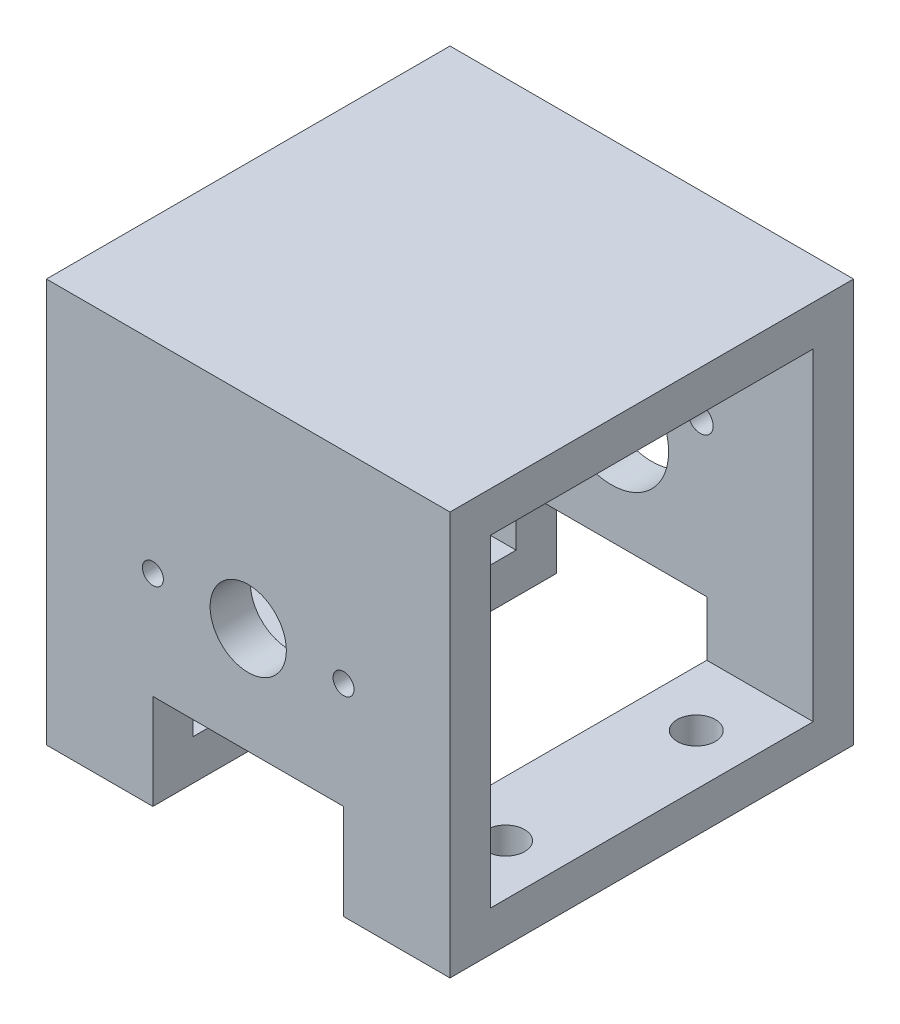
ISO-10303-21;
HEADER;
FILE_DESCRIPTION(('STEP AP214'),'2;1');
FILE_NAME('part.step','',(''),(''),'','','');
FILE_SCHEMA(('AUTOMOTIVE_DESIGN { 1 0 10303 214 1 1 1 1 }'));
ENDSEC;
DATA;
#1=APPLICATION_CONTEXT('core data for automotive mechanical design processes');
#2=APPLICATION_PROTOCOL_DEFINITION('international standard','automotive_design',2000,#1);
#3=PRODUCT_CONTEXT('',#1,'mechanical');
#4=PRODUCT('Part','Part','',(#3));
#5=PRODUCT_RELATED_PRODUCT_CATEGORY('part','',(#4));
#6=PRODUCT_DEFINITION_FORMATION('','',#4);
#7=PRODUCT_DEFINITION_CONTEXT('part definition',#1,'design');
#8=PRODUCT_DEFINITION('design','',#6,#7);
#9=PRODUCT_DEFINITION_SHAPE('','',#8);
#10=(LENGTH_UNIT() NAMED_UNIT(*) SI_UNIT(.MILLI.,.METRE.));
#11=(NAMED_UNIT(*) PLANE_ANGLE_UNIT() SI_UNIT($,.RADIAN.));
#12=(NAMED_UNIT(*) SI_UNIT($,.STERADIAN.) SOLID_ANGLE_UNIT());
#13=UNCERTAINTY_MEASURE_WITH_UNIT(LENGTH_MEASURE(1.E-05),#10,'distance_accuracy_value','');
#14=(GEOMETRIC_REPRESENTATION_CONTEXT(3) GLOBAL_UNCERTAINTY_ASSIGNED_CONTEXT((#13)) GLOBAL_UNIT_ASSIGNED_CONTEXT((#10,
#11,#12)) REPRESENTATION_CONTEXT('',''));
#15=CARTESIAN_POINT('',(0.,0.,0.));
#16=DIRECTION('',(0.,0.,1.));
#17=DIRECTION('',(1.,0.,0.));
#18=AXIS2_PLACEMENT_3D('',#15,#16,#17);
#19=CARTESIAN_POINT('',(0.,-31.75,0.));
#20=DIRECTION('',(0.,-1.,0.));
#21=DIRECTION('',(0.,0.,-1.));
#22=AXIS2_PLACEMENT_3D('',#19,#20,#21);
#23=PLANE('',#22);
#24=CARTESIAN_POINT('',(23.75,-31.75,-15.));
#25=DIRECTION('',(0.,1.,0.));
#26=DIRECTION('',(0.,0.,1.));
#27=AXIS2_PLACEMENT_3D('',#24,#25,#26);
#28=CIRCLE('',#27,3.);
#29=CARTESIAN_POINT('',(23.75,-31.75,-12.));
#30=VERTEX_POINT('',#29);
#31=EDGE_CURVE('E632',#30,#30,#28,.T.);
#32=ORIENTED_EDGE('',*,*,#31,.T.);
#33=EDGE_LOOP('',(#32));
#34=FACE_BOUND('',#33,.T.);
#35=CARTESIAN_POINT('',(23.75,-31.75,15.));
#36=DIRECTION('',(0.,1.,0.));
#37=DIRECTION('',(0.,0.,-1.));
#38=AXIS2_PLACEMENT_3D('',#35,#36,#37);
#39=CIRCLE('',#38,3.);
#40=CARTESIAN_POINT('',(23.75,-31.75,12.));
#41=VERTEX_POINT('',#40);
#42=EDGE_CURVE('E633',#41,#41,#39,.T.);
#43=ORIENTED_EDGE('',*,*,#42,.T.);
#44=EDGE_LOOP('',(#43));
#45=FACE_BOUND('',#44,.T.);
#46=DIRECTION('',(0.,0.,1.));
#47=VECTOR('',#46,1.);
#48=CARTESIAN_POINT('',(15.,-31.75,-31.75));
#49=LINE('',#48,#47);
#50=CARTESIAN_POINT('',(15.,-31.75,-31.75));
#51=VERTEX_POINT('',#50);
#52=CARTESIAN_POINT('',(15.,-31.75,31.75));
#53=VERTEX_POINT('',#52);
#54=EDGE_CURVE('E169',#51,#53,#49,.T.);
#55=ORIENTED_EDGE('',*,*,#54,.F.);
#56=DIRECTION('',(-1.,0.,0.));
#57=VECTOR('',#56,1.);
#58=CARTESIAN_POINT('',(-31.75,-31.75,-31.75));
#59=LINE('',#58,#57);
#60=CARTESIAN_POINT('',(31.75,-31.75,-31.75));
#61=VERTEX_POINT('',#60);
#62=EDGE_CURVE('E256',#61,#51,#59,.T.);
#63=ORIENTED_EDGE('',*,*,#62,.F.);
#64=DIRECTION('',(0.,0.,-1.));
#65=VECTOR('',#64,1.);
#66=CARTESIAN_POINT('',(31.75,-31.75,31.75));
#67=LINE('',#66,#65);
#68=CARTESIAN_POINT('',(31.75,-31.75,31.75));
#69=VERTEX_POINT('',#68);
#70=EDGE_CURVE('E235',#69,#61,#67,.T.);
#71=ORIENTED_EDGE('',*,*,#70,.F.);
#72=DIRECTION('',(1.,0.,0.));
#73=VECTOR('',#72,1.);
#74=CARTESIAN_POINT('',(-31.75,-31.75,31.75));
#75=LINE('',#74,#73);
#76=EDGE_CURVE('E261',#53,#69,#75,.T.);
#77=ORIENTED_EDGE('',*,*,#76,.F.);
#78=EDGE_LOOP('',(#55,#63,#71,#77));
#79=FACE_BOUND('',#78,.T.);
#80=ADVANCED_FACE('F39',(#34,#45,#79),#23,.T.);
#81=CARTESIAN_POINT('',(0.,-25.4,0.));
#82=DIRECTION('',(0.,-1.,0.));
#83=DIRECTION('',(0.,0.,-1.));
#84=AXIS2_PLACEMENT_3D('',#81,#82,#83);
#85=PLANE('',#84);
#86=CARTESIAN_POINT('',(23.75,-25.4,-15.));
#87=DIRECTION('',(0.,-1.,0.));
#88=DIRECTION('',(0.,0.,-1.));
#89=AXIS2_PLACEMENT_3D('',#86,#87,#88);
#90=CIRCLE('',#89,3.);
#91=CARTESIAN_POINT('',(23.75,-25.4,-18.));
#92=VERTEX_POINT('',#91);
#93=EDGE_CURVE('E43',#92,#92,#90,.T.);
#94=ORIENTED_EDGE('',*,*,#93,.T.);
#95=EDGE_LOOP('',(#94));
#96=FACE_BOUND('',#95,.T.);
#97=CARTESIAN_POINT('',(23.75,-25.4,15.));
#98=DIRECTION('',(0.,-1.,0.));
#99=DIRECTION('',(0.,0.,-1.));
#100=AXIS2_PLACEMENT_3D('',#97,#98,#99);
#101=CIRCLE('',#100,3.);
#102=CARTESIAN_POINT('',(23.75,-25.4,12.));
#103=VERTEX_POINT('',#102);
#104=EDGE_CURVE('E298',#103,#103,#101,.T.);
#105=ORIENTED_EDGE('',*,*,#104,.T.);
#106=EDGE_LOOP('',(#105));
#107=FACE_BOUND('',#106,.T.);
#108=DIRECTION('',(-1.,0.,0.));
#109=VECTOR('',#108,1.);
#110=CARTESIAN_POINT('',(0.,-25.4,-25.4));
#111=LINE('',#110,#109);
#112=CARTESIAN_POINT('',(31.75,-25.4,-25.4));
#113=VERTEX_POINT('',#112);
#114=CARTESIAN_POINT('',(15.,-25.4,-25.4));
#115=VERTEX_POINT('',#114);
#116=EDGE_CURVE('E205',#113,#115,#111,.T.);
#117=ORIENTED_EDGE('',*,*,#116,.T.);
#118=DIRECTION('',(0.,0.,1.));
#119=VECTOR('',#118,1.);
#120=CARTESIAN_POINT('',(15.,-25.4,0.));
#121=LINE('',#120,#119);
#122=CARTESIAN_POINT('',(15.,-25.4,25.4));
#123=VERTEX_POINT('',#122);
#124=EDGE_CURVE('E48',#115,#123,#121,.T.);
#125=ORIENTED_EDGE('',*,*,#124,.T.);
#126=DIRECTION('',(1.,0.,0.));
#127=VECTOR('',#126,1.);
#128=CARTESIAN_POINT('',(0.,-25.4,25.4));
#129=LINE('',#128,#127);
#130=CARTESIAN_POINT('',(31.75,-25.4,25.4));
#131=VERTEX_POINT('',#130);
#132=EDGE_CURVE('E222',#123,#131,#129,.T.);
#133=ORIENTED_EDGE('',*,*,#132,.T.);
#134=DIRECTION('',(0.,0.,-1.));
#135=VECTOR('',#134,1.);
#136=CARTESIAN_POINT('',(31.75,-25.4,0.));
#137=LINE('',#136,#135);
#138=EDGE_CURVE('E204',#131,#113,#137,.T.);
#139=ORIENTED_EDGE('',*,*,#138,.T.);
#140=EDGE_LOOP('',(#117,#125,#133,#139));
#141=FACE_BOUND('',#140,.T.);
#142=ADVANCED_FACE('F352',(#96,#107,#141),#85,.F.);
#143=CARTESIAN_POINT('',(31.75,31.75,31.75));
#144=DIRECTION('',(-1.,0.,0.));
#145=DIRECTION('',(0.,0.,1.));
#146=AXIS2_PLACEMENT_3D('',#143,#144,#145);
#147=PLANE('',#146);
#148=ORIENTED_EDGE('',*,*,#70,.T.);
#149=DIRECTION('',(0.,-1.,0.));
#150=VECTOR('',#149,1.);
#151=CARTESIAN_POINT('',(31.75,31.75,-31.75));
#152=LINE('',#151,#150);
#153=CARTESIAN_POINT('',(31.75,31.75,-31.75));
#154=VERTEX_POINT('',#153);
#155=EDGE_CURVE('E271',#154,#61,#152,.T.);
#156=ORIENTED_EDGE('',*,*,#155,.F.);
#157=DIRECTION('',(0.,0.,-1.));
#158=VECTOR('',#157,1.);
#159=CARTESIAN_POINT('',(31.75,31.75,31.75));
#160=LINE('',#159,#158);
#161=CARTESIAN_POINT('',(31.75,31.75,31.75));
#162=VERTEX_POINT('',#161);
#163=EDGE_CURVE('E242',#162,#154,#160,.T.);
#164=ORIENTED_EDGE('',*,*,#163,.F.);
#165=DIRECTION('',(0.,-1.,0.));
#166=VECTOR('',#165,1.);
#167=CARTESIAN_POINT('',(31.75,31.75,31.75));
#168=LINE('',#167,#166);
#169=EDGE_CURVE('E252',#162,#69,#168,.T.);
#170=ORIENTED_EDGE('',*,*,#169,.T.);
#171=EDGE_LOOP('',(#148,#156,#164,#170));
#172=FACE_BOUND('',#171,.T.);
#173=ORIENTED_EDGE('',*,*,#138,.F.);
#174=DIRECTION('',(0.,-1.,0.));
#175=VECTOR('',#174,1.);
#176=CARTESIAN_POINT('',(31.75,31.75,25.4));
#177=LINE('',#176,#175);
#178=CARTESIAN_POINT('',(31.75,25.4,25.4));
#179=VERTEX_POINT('',#178);
#180=EDGE_CURVE('E218',#179,#131,#177,.T.);
#181=ORIENTED_EDGE('',*,*,#180,.F.);
#182=DIRECTION('',(0.,0.,-1.));
#183=VECTOR('',#182,1.);
#184=CARTESIAN_POINT('',(31.75,25.4,0.));
#185=LINE('',#184,#183);
#186=CARTESIAN_POINT('',(31.75,25.4,-25.4));
#187=VERTEX_POINT('',#186);
#188=EDGE_CURVE('E214',#179,#187,#185,.T.);
#189=ORIENTED_EDGE('',*,*,#188,.T.);
#190=DIRECTION('',(0.,-1.,0.));
#191=VECTOR('',#190,1.);
#192=CARTESIAN_POINT('',(31.75,31.75,-25.4));
#193=LINE('',#192,#191);
#194=EDGE_CURVE('E226',#187,#113,#193,.T.);
#195=ORIENTED_EDGE('',*,*,#194,.T.);
#196=EDGE_LOOP('',(#173,#181,#189,#195));
#197=FACE_BOUND('',#196,.T.);
#198=ADVANCED_FACE('F41',(#172,#197),#147,.F.);
#199=CARTESIAN_POINT('',(-31.75,31.75,31.75));
#200=DIRECTION('',(1.,0.,0.));
#201=DIRECTION('',(0.,0.,-1.));
#202=AXIS2_PLACEMENT_3D('',#199,#200,#201);
#203=PLANE('',#202);
#204=DIRECTION('',(0.,0.,1.));
#205=VECTOR('',#204,1.);
#206=CARTESIAN_POINT('',(-31.75,-31.75,31.75));
#207=LINE('',#206,#205);
#208=CARTESIAN_POINT('',(-31.75,-31.75,-31.75));
#209=VERTEX_POINT('',#208);
#210=CARTESIAN_POINT('',(-31.75,-31.75,31.75));
#211=VERTEX_POINT('',#210);
#212=EDGE_CURVE('E259',#209,#211,#207,.T.);
#213=ORIENTED_EDGE('',*,*,#212,.T.);
#214=DIRECTION('',(0.,-1.,0.));
#215=VECTOR('',#214,1.);
#216=CARTESIAN_POINT('',(-31.75,31.75,31.75));
#217=LINE('',#216,#215);
#218=CARTESIAN_POINT('',(-31.75,31.75,31.75));
#219=VERTEX_POINT('',#218);
#220=EDGE_CURVE('E265',#219,#211,#217,.T.);
#221=ORIENTED_EDGE('',*,*,#220,.F.);
#222=DIRECTION('',(0.,0.,1.));
#223=VECTOR('',#222,1.);
#224=CARTESIAN_POINT('',(-31.75,31.75,31.75));
#225=LINE('',#224,#223);
#226=CARTESIAN_POINT('',(-31.75,31.75,-31.75));
#227=VERTEX_POINT('',#226);
#228=EDGE_CURVE('E248',#227,#219,#225,.T.);
#229=ORIENTED_EDGE('',*,*,#228,.F.);
#230=DIRECTION('',(0.,-1.,0.));
#231=VECTOR('',#230,1.);
#232=CARTESIAN_POINT('',(-31.75,31.75,-31.75));
#233=LINE('',#232,#231);
#234=EDGE_CURVE('E268',#227,#209,#233,.T.);
#235=ORIENTED_EDGE('',*,*,#234,.T.);
#236=EDGE_LOOP('',(#213,#221,#229,#235));
#237=FACE_BOUND('',#236,.T.);
#238=DIRECTION('',(0.,0.,1.));
#239=VECTOR('',#238,1.);
#240=CARTESIAN_POINT('',(-31.75,-25.4,0.));
#241=LINE('',#240,#239);
#242=CARTESIAN_POINT('',(-31.75,-25.4,-25.4));
#243=VERTEX_POINT('',#242);
#244=CARTESIAN_POINT('',(-31.75,-25.4,25.4));
#245=VERTEX_POINT('',#244);
#246=EDGE_CURVE('E208',#243,#245,#241,.T.);
#247=ORIENTED_EDGE('',*,*,#246,.F.);
#248=DIRECTION('',(0.,-1.,0.));
#249=VECTOR('',#248,1.);
#250=CARTESIAN_POINT('',(-31.75,31.75,-25.4));
#251=LINE('',#250,#249);
#252=CARTESIAN_POINT('',(-31.75,25.4,-25.4));
#253=VERTEX_POINT('',#252);
#254=EDGE_CURVE('E223',#253,#243,#251,.T.);
#255=ORIENTED_EDGE('',*,*,#254,.F.);
#256=DIRECTION('',(0.,0.,1.));
#257=VECTOR('',#256,1.);
#258=CARTESIAN_POINT('',(-31.75,25.4,0.));
#259=LINE('',#258,#257);
#260=CARTESIAN_POINT('',(-31.75,25.4,25.4));
#261=VERTEX_POINT('',#260);
#262=EDGE_CURVE('E213',#253,#261,#259,.T.);
#263=ORIENTED_EDGE('',*,*,#262,.T.);
#264=DIRECTION('',(0.,-1.,0.));
#265=VECTOR('',#264,1.);
#266=CARTESIAN_POINT('',(-31.75,31.75,25.4));
#267=LINE('',#266,#265);
#268=EDGE_CURVE('E227',#261,#245,#267,.T.);
#269=ORIENTED_EDGE('',*,*,#268,.T.);
#270=EDGE_LOOP('',(#247,#255,#263,#269));
#271=FACE_BOUND('',#270,.T.);
#272=ADVANCED_FACE('F346',(#237,#271),#203,.F.);
#273=CARTESIAN_POINT('',(-31.75,31.75,-31.75));
#274=DIRECTION('',(0.,0.,1.));
#275=DIRECTION('',(1.,0.,0.));
#276=AXIS2_PLACEMENT_3D('',#273,#274,#275);
#277=PLANE('',#276);
#278=CARTESIAN_POINT('',(14.,7.,-31.75));
#279=DIRECTION('',(0.,0.,1.));
#280=DIRECTION('',(-1.,0.,0.));
#281=AXIS2_PLACEMENT_3D('',#278,#279,#280);
#282=CIRCLE('',#281,2.);
#283=CARTESIAN_POINT('',(12.,7.,-31.75));
#284=VERTEX_POINT('',#283);
#285=EDGE_CURVE('E303',#284,#284,#282,.T.);
#286=ORIENTED_EDGE('',*,*,#285,.T.);
#287=EDGE_LOOP('',(#286));
#288=FACE_BOUND('',#287,.T.);
#289=CARTESIAN_POINT('',(-14.,7.,-31.75));
#290=DIRECTION('',(0.,0.,1.));
#291=DIRECTION('',(1.,0.,0.));
#292=AXIS2_PLACEMENT_3D('',#289,#290,#291);
#293=CIRCLE('',#292,2.);
#294=CARTESIAN_POINT('',(-12.,7.,-31.75));
#295=VERTEX_POINT('',#294);
#296=EDGE_CURVE('E307',#295,#295,#293,.T.);
#297=ORIENTED_EDGE('',*,*,#296,.T.);
#298=EDGE_LOOP('',(#297));
#299=FACE_BOUND('',#298,.T.);
#300=CARTESIAN_POINT('',(0.,0.,-31.75));
#301=DIRECTION('',(0.,0.,1.));
#302=DIRECTION('',(1.,0.,0.));
#303=AXIS2_PLACEMENT_3D('',#300,#301,#302);
#304=CIRCLE('',#303,9.);
#305=CARTESIAN_POINT('',(9.,0.,-31.75));
#306=VERTEX_POINT('',#305);
#307=EDGE_CURVE('E285',#306,#306,#304,.T.);
#308=ORIENTED_EDGE('',*,*,#307,.T.);
#309=EDGE_LOOP('',(#308));
#310=FACE_BOUND('',#309,.T.);
#311=ORIENTED_EDGE('',*,*,#62,.T.);
#312=DIRECTION('',(0.,1.,0.));
#313=VECTOR('',#312,1.);
#314=CARTESIAN_POINT('',(15.,-16.75,-31.75));
#315=LINE('',#314,#313);
#316=CARTESIAN_POINT('',(15.,-16.75,-31.75));
#317=VERTEX_POINT('',#316);
#318=EDGE_CURVE('E177',#51,#317,#315,.T.);
#319=ORIENTED_EDGE('',*,*,#318,.T.);
#320=DIRECTION('',(-1.,0.,0.));
#321=VECTOR('',#320,1.);
#322=CARTESIAN_POINT('',(-15.,-16.75,-31.75));
#323=LINE('',#322,#321);
#324=CARTESIAN_POINT('',(-15.,-16.75,-31.75));
#325=VERTEX_POINT('',#324);
#326=EDGE_CURVE('E183',#317,#325,#323,.T.);
#327=ORIENTED_EDGE('',*,*,#326,.T.);
#328=DIRECTION('',(0.,-1.,0.));
#329=VECTOR('',#328,1.);
#330=CARTESIAN_POINT('',(-15.,-16.75,-31.75));
#331=LINE('',#330,#329);
#332=CARTESIAN_POINT('',(-15.,-31.75,-31.75));
#333=VERTEX_POINT('',#332);
#334=EDGE_CURVE('E163',#325,#333,#331,.T.);
#335=ORIENTED_EDGE('',*,*,#334,.T.);
#336=EDGE_CURVE('E255',#333,#209,#59,.T.);
#337=ORIENTED_EDGE('',*,*,#336,.T.);
#338=ORIENTED_EDGE('',*,*,#234,.F.);
#339=DIRECTION('',(-1.,0.,0.));
#340=VECTOR('',#339,1.);
#341=CARTESIAN_POINT('',(-31.75,31.75,-31.75));
#342=LINE('',#341,#340);
#343=EDGE_CURVE('E245',#154,#227,#342,.T.);
#344=ORIENTED_EDGE('',*,*,#343,.F.);
#345=ORIENTED_EDGE('',*,*,#155,.T.);
#346=EDGE_LOOP('',(#311,#319,#327,#335,#337,#338,#344,#345));
#347=FACE_BOUND('',#346,.T.);
#348=ADVANCED_FACE('F334',(#288,#299,#310,#347),#277,.F.);
#349=CARTESIAN_POINT('',(-31.75,31.75,31.75));
#350=DIRECTION('',(0.,0.,-1.));
#351=DIRECTION('',(-1.,0.,0.));
#352=AXIS2_PLACEMENT_3D('',#349,#350,#351);
#353=PLANE('',#352);
#354=CARTESIAN_POINT('',(-15.,0.,31.75));
#355=DIRECTION('',(0.,0.,1.));
#356=DIRECTION('',(1.,0.,0.));
#357=AXIS2_PLACEMENT_3D('',#354,#355,#356);
#358=CIRCLE('',#357,1.64999999999999);
#359=CARTESIAN_POINT('',(-13.35,0.,31.75));
#360=VERTEX_POINT('',#359);
#361=EDGE_CURVE('E291',#360,#360,#358,.T.);
#362=ORIENTED_EDGE('',*,*,#361,.F.);
#363=EDGE_LOOP('',(#362));
#364=FACE_BOUND('',#363,.T.);
#365=CARTESIAN_POINT('',(15.,0.,31.75));
#366=DIRECTION('',(0.,0.,1.));
#367=DIRECTION('',(1.,0.,0.));
#368=AXIS2_PLACEMENT_3D('',#365,#366,#367);
#369=CIRCLE('',#368,1.64999999999999);
#370=CARTESIAN_POINT('',(16.65,0.,31.75));
#371=VERTEX_POINT('',#370);
#372=EDGE_CURVE('E322',#371,#371,#369,.T.);
#373=ORIENTED_EDGE('',*,*,#372,.F.);
#374=EDGE_LOOP('',(#373));
#375=FACE_BOUND('',#374,.T.);
#376=CARTESIAN_POINT('',(0.,0.,31.75));
#377=DIRECTION('',(0.,0.,1.));
#378=DIRECTION('',(1.,0.,0.));
#379=AXIS2_PLACEMENT_3D('',#376,#377,#378);
#380=CIRCLE('',#379,6.);
#381=CARTESIAN_POINT('',(6.,0.,31.75));
#382=VERTEX_POINT('',#381);
#383=EDGE_CURVE('E280',#382,#382,#380,.T.);
#384=ORIENTED_EDGE('',*,*,#383,.F.);
#385=EDGE_LOOP('',(#384));
#386=FACE_BOUND('',#385,.T.);
#387=DIRECTION('',(-1.,0.,0.));
#388=VECTOR('',#387,1.);
#389=CARTESIAN_POINT('',(-15.,-16.75,31.75));
#390=LINE('',#389,#388);
#391=CARTESIAN_POINT('',(15.,-16.75,31.75));
#392=VERTEX_POINT('',#391);
#393=CARTESIAN_POINT('',(-15.,-16.75,31.75));
#394=VERTEX_POINT('',#393);
#395=EDGE_CURVE('E158',#392,#394,#390,.T.);
#396=ORIENTED_EDGE('',*,*,#395,.F.);
#397=DIRECTION('',(0.,1.,0.));
#398=VECTOR('',#397,1.);
#399=CARTESIAN_POINT('',(15.,-16.75,31.75));
#400=LINE('',#399,#398);
#401=EDGE_CURVE('E166',#53,#392,#400,.T.);
#402=ORIENTED_EDGE('',*,*,#401,.F.);
#403=ORIENTED_EDGE('',*,*,#76,.T.);
#404=ORIENTED_EDGE('',*,*,#169,.F.);
#405=DIRECTION('',(1.,0.,0.));
#406=VECTOR('',#405,1.);
#407=CARTESIAN_POINT('',(-31.75,31.75,31.75));
#408=LINE('',#407,#406);
#409=EDGE_CURVE('E250',#219,#162,#408,.T.);
#410=ORIENTED_EDGE('',*,*,#409,.F.);
#411=ORIENTED_EDGE('',*,*,#220,.T.);
#412=CARTESIAN_POINT('',(-15.,-31.75,31.75));
#413=VERTEX_POINT('',#412);
#414=EDGE_CURVE('E246',#211,#413,#75,.T.);
#415=ORIENTED_EDGE('',*,*,#414,.T.);
#416=DIRECTION('',(0.,-1.,0.));
#417=VECTOR('',#416,1.);
#418=CARTESIAN_POINT('',(-15.,-16.75,31.75));
#419=LINE('',#418,#417);
#420=EDGE_CURVE('E56',#394,#413,#419,.T.);
#421=ORIENTED_EDGE('',*,*,#420,.F.);
#422=EDGE_LOOP('',(#396,#402,#403,#404,#410,#411,#415,#421));
#423=FACE_BOUND('',#422,.T.);
#424=ADVANCED_FACE('F174',(#364,#375,#386,#423),#353,.F.);
#425=CARTESIAN_POINT('',(0.,31.75,0.));
#426=DIRECTION('',(0.,-1.,0.));
#427=DIRECTION('',(0.,0.,-1.));
#428=AXIS2_PLACEMENT_3D('',#425,#426,#427);
#429=PLANE('',#428);
#430=ORIENTED_EDGE('',*,*,#163,.T.);
#431=ORIENTED_EDGE('',*,*,#343,.T.);
#432=ORIENTED_EDGE('',*,*,#228,.T.);
#433=ORIENTED_EDGE('',*,*,#409,.T.);
#434=EDGE_LOOP('',(#430,#431,#432,#433));
#435=FACE_BOUND('',#434,.T.);
#436=ADVANCED_FACE('F333',(#435),#429,.F.);
#437=CARTESIAN_POINT('',(-23.75,-31.75,-15.));
#438=DIRECTION('',(0.,1.,0.));
#439=DIRECTION('',(0.,0.,-1.));
#440=AXIS2_PLACEMENT_3D('',#437,#438,#439);
#441=CIRCLE('',#440,3.);
#442=CARTESIAN_POINT('',(-23.75,-31.75,-18.));
#443=VERTEX_POINT('',#442);
#444=EDGE_CURVE('E375',#443,#443,#441,.T.);
#445=ORIENTED_EDGE('',*,*,#444,.T.);
#446=EDGE_LOOP('',(#445));
#447=FACE_BOUND('',#446,.T.);
#448=CARTESIAN_POINT('',(-23.75,-31.75,15.));
#449=DIRECTION('',(0.,1.,0.));
#450=DIRECTION('',(0.,0.,1.));
#451=AXIS2_PLACEMENT_3D('',#448,#449,#450);
#452=CIRCLE('',#451,3.);
#453=CARTESIAN_POINT('',(-23.75,-31.75,18.));
#454=VERTEX_POINT('',#453);
#455=EDGE_CURVE('E296',#454,#454,#452,.T.);
#456=ORIENTED_EDGE('',*,*,#455,.T.);
#457=EDGE_LOOP('',(#456));
#458=FACE_BOUND('',#457,.T.);
#459=DIRECTION('',(0.,0.,1.));
#460=VECTOR('',#459,1.);
#461=CARTESIAN_POINT('',(-15.,-31.75,-31.75));
#462=LINE('',#461,#460);
#463=EDGE_CURVE('E190',#333,#413,#462,.T.);
#464=ORIENTED_EDGE('',*,*,#463,.T.);
#465=ORIENTED_EDGE('',*,*,#414,.F.);
#466=ORIENTED_EDGE('',*,*,#212,.F.);
#467=ORIENTED_EDGE('',*,*,#336,.F.);
#468=EDGE_LOOP('',(#464,#465,#466,#467));
#469=FACE_BOUND('',#468,.T.);
#470=ADVANCED_FACE('F342',(#447,#458,#469),#23,.T.);
#471=CARTESIAN_POINT('',(-31.75,31.75,-25.4));
#472=DIRECTION('',(0.,0.,1.));
#473=DIRECTION('',(1.,0.,0.));
#474=AXIS2_PLACEMENT_3D('',#471,#472,#473);
#475=PLANE('',#474);
#476=CARTESIAN_POINT('',(14.,7.,-25.4));
#477=DIRECTION('',(0.,0.,1.));
#478=DIRECTION('',(1.,0.,0.));
#479=AXIS2_PLACEMENT_3D('',#476,#477,#478);
#480=CIRCLE('',#479,2.);
#481=CARTESIAN_POINT('',(16.,7.,-25.4));
#482=VERTEX_POINT('',#481);
#483=EDGE_CURVE('E288',#482,#482,#480,.T.);
#484=ORIENTED_EDGE('',*,*,#483,.F.);
#485=EDGE_LOOP('',(#484));
#486=FACE_BOUND('',#485,.T.);
#487=CARTESIAN_POINT('',(-14.,7.,-25.4));
#488=DIRECTION('',(0.,0.,1.));
#489=DIRECTION('',(1.,0.,0.));
#490=AXIS2_PLACEMENT_3D('',#487,#488,#489);
#491=CIRCLE('',#490,2.);
#492=CARTESIAN_POINT('',(-12.,7.,-25.4));
#493=VERTEX_POINT('',#492);
#494=EDGE_CURVE('E284',#493,#493,#491,.T.);
#495=ORIENTED_EDGE('',*,*,#494,.F.);
#496=EDGE_LOOP('',(#495));
#497=FACE_BOUND('',#496,.T.);
#498=CARTESIAN_POINT('',(0.,0.,-25.4));
#499=DIRECTION('',(0.,0.,1.));
#500=DIRECTION('',(1.,0.,0.));
#501=AXIS2_PLACEMENT_3D('',#498,#499,#500);
#502=CIRCLE('',#501,9.);
#503=CARTESIAN_POINT('',(9.,0.,-25.4));
#504=VERTEX_POINT('',#503);
#505=EDGE_CURVE('E281',#504,#504,#502,.T.);
#506=ORIENTED_EDGE('',*,*,#505,.F.);
#507=EDGE_LOOP('',(#506));
#508=FACE_BOUND('',#507,.T.);
#509=DIRECTION('',(0.,1.,0.));
#510=VECTOR('',#509,1.);
#511=CARTESIAN_POINT('',(14.9999999999999,31.7500000000001,-25.4));
#512=LINE('',#511,#510);
#513=CARTESIAN_POINT('',(15.,-16.75,-25.4));
#514=VERTEX_POINT('',#513);
#515=EDGE_CURVE('E200',#115,#514,#512,.T.);
#516=ORIENTED_EDGE('',*,*,#515,.F.);
#517=ORIENTED_EDGE('',*,*,#116,.F.);
#518=ORIENTED_EDGE('',*,*,#194,.F.);
#519=DIRECTION('',(-1.,0.,0.));
#520=VECTOR('',#519,1.);
#521=CARTESIAN_POINT('',(0.,25.4,-25.4));
#522=LINE('',#521,#520);
#523=EDGE_CURVE('E210',#187,#253,#522,.T.);
#524=ORIENTED_EDGE('',*,*,#523,.T.);
#525=ORIENTED_EDGE('',*,*,#254,.T.);
#526=CARTESIAN_POINT('',(-15.,-25.4,-25.4));
#527=VERTEX_POINT('',#526);
#528=EDGE_CURVE('E209',#527,#243,#111,.T.);
#529=ORIENTED_EDGE('',*,*,#528,.F.);
#530=DIRECTION('',(0.,-1.,0.));
#531=VECTOR('',#530,1.);
#532=CARTESIAN_POINT('',(-15.,31.75,-25.4));
#533=LINE('',#532,#531);
#534=CARTESIAN_POINT('',(-15.,-16.75,-25.4));
#535=VERTEX_POINT('',#534);
#536=EDGE_CURVE('E63',#535,#527,#533,.T.);
#537=ORIENTED_EDGE('',*,*,#536,.F.);
#538=DIRECTION('',(-1.,0.,0.));
#539=VECTOR('',#538,1.);
#540=CARTESIAN_POINT('',(-31.75,-16.75,-25.4));
#541=LINE('',#540,#539);
#542=EDGE_CURVE('E202',#514,#535,#541,.T.);
#543=ORIENTED_EDGE('',*,*,#542,.F.);
#544=EDGE_LOOP('',(#516,#517,#518,#524,#525,#529,#537,#543));
#545=FACE_BOUND('',#544,.T.);
#546=ADVANCED_FACE('F363',(#486,#497,#508,#545),#475,.T.);
#547=CARTESIAN_POINT('',(-31.75,31.75,25.4));
#548=DIRECTION('',(0.,0.,-1.));
#549=DIRECTION('',(-1.,0.,0.));
#550=AXIS2_PLACEMENT_3D('',#547,#548,#549);
#551=PLANE('',#550);
#552=CARTESIAN_POINT('',(-15.,0.,25.4));
#553=DIRECTION('',(0.,0.,-1.));
#554=DIRECTION('',(-1.,0.,0.));
#555=AXIS2_PLACEMENT_3D('',#552,#553,#554);
#556=CIRCLE('',#555,1.64999999999999);
#557=CARTESIAN_POINT('',(-16.65,0.,25.4));
#558=VERTEX_POINT('',#557);
#559=EDGE_CURVE('E319',#558,#558,#556,.T.);
#560=ORIENTED_EDGE('',*,*,#559,.F.);
#561=EDGE_LOOP('',(#560));
#562=FACE_BOUND('',#561,.T.);
#563=CARTESIAN_POINT('',(15.,0.,25.4));
#564=DIRECTION('',(0.,0.,-1.));
#565=DIRECTION('',(-1.,0.,0.));
#566=AXIS2_PLACEMENT_3D('',#563,#564,#565);
#567=CIRCLE('',#566,1.64999999999999);
#568=CARTESIAN_POINT('',(13.35,0.,25.4));
#569=VERTEX_POINT('',#568);
#570=EDGE_CURVE('E325',#569,#569,#567,.T.);
#571=ORIENTED_EDGE('',*,*,#570,.F.);
#572=EDGE_LOOP('',(#571));
#573=FACE_BOUND('',#572,.T.);
#574=CARTESIAN_POINT('',(0.,0.,25.4));
#575=DIRECTION('',(0.,0.,-1.));
#576=DIRECTION('',(-1.,0.,0.));
#577=AXIS2_PLACEMENT_3D('',#574,#575,#576);
#578=CIRCLE('',#577,6.);
#579=CARTESIAN_POINT('',(-6.,0.,25.4));
#580=VERTEX_POINT('',#579);
#581=EDGE_CURVE('E172',#580,#580,#578,.F.);
#582=ORIENTED_EDGE('',*,*,#581,.T.);
#583=EDGE_LOOP('',(#582));
#584=FACE_BOUND('',#583,.T.);
#585=DIRECTION('',(0.,-1.,0.));
#586=VECTOR('',#585,1.);
#587=CARTESIAN_POINT('',(14.9999999999999,31.7500000000001,25.4));
#588=LINE('',#587,#586);
#589=CARTESIAN_POINT('',(15.,-16.75,25.4));
#590=VERTEX_POINT('',#589);
#591=EDGE_CURVE('E198',#590,#123,#588,.T.);
#592=ORIENTED_EDGE('',*,*,#591,.F.);
#593=DIRECTION('',(1.,0.,0.));
#594=VECTOR('',#593,1.);
#595=CARTESIAN_POINT('',(-31.75,-16.75,25.4));
#596=LINE('',#595,#594);
#597=CARTESIAN_POINT('',(-15.,-16.75,25.4));
#598=VERTEX_POINT('',#597);
#599=EDGE_CURVE('E11',#598,#590,#596,.T.);
#600=ORIENTED_EDGE('',*,*,#599,.F.);
#601=DIRECTION('',(0.,1.,0.));
#602=VECTOR('',#601,1.);
#603=CARTESIAN_POINT('',(-15.,31.75,25.4));
#604=LINE('',#603,#602);
#605=CARTESIAN_POINT('',(-15.,-25.4,25.4));
#606=VERTEX_POINT('',#605);
#607=EDGE_CURVE('E189',#606,#598,#604,.T.);
#608=ORIENTED_EDGE('',*,*,#607,.F.);
#609=EDGE_CURVE('E219',#245,#606,#129,.T.);
#610=ORIENTED_EDGE('',*,*,#609,.F.);
#611=ORIENTED_EDGE('',*,*,#268,.F.);
#612=DIRECTION('',(1.,0.,0.));
#613=VECTOR('',#612,1.);
#614=CARTESIAN_POINT('',(0.,25.4,25.4));
#615=LINE('',#614,#613);
#616=EDGE_CURVE('E215',#261,#179,#615,.T.);
#617=ORIENTED_EDGE('',*,*,#616,.T.);
#618=ORIENTED_EDGE('',*,*,#180,.T.);
#619=ORIENTED_EDGE('',*,*,#132,.F.);
#620=EDGE_LOOP('',(#592,#600,#608,#610,#611,#617,#618,#619));
#621=FACE_BOUND('',#620,.T.);
#622=ADVANCED_FACE('F369',(#562,#573,#584,#621),#551,.T.);
#623=CARTESIAN_POINT('',(0.,25.4,0.));
#624=DIRECTION('',(0.,-1.,0.));
#625=DIRECTION('',(0.,0.,-1.));
#626=AXIS2_PLACEMENT_3D('',#623,#624,#625);
#627=PLANE('',#626);
#628=ORIENTED_EDGE('',*,*,#188,.F.);
#629=ORIENTED_EDGE('',*,*,#616,.F.);
#630=ORIENTED_EDGE('',*,*,#262,.F.);
#631=ORIENTED_EDGE('',*,*,#523,.F.);
#632=EDGE_LOOP('',(#628,#629,#630,#631));
#633=FACE_BOUND('',#632,.T.);
#634=ADVANCED_FACE('F419',(#633),#627,.T.);
#635=CARTESIAN_POINT('',(-23.75,-25.4,-15.));
#636=DIRECTION('',(0.,-1.,0.));
#637=DIRECTION('',(0.,0.,-1.));
#638=AXIS2_PLACEMENT_3D('',#635,#636,#637);
#639=CIRCLE('',#638,3.);
#640=CARTESIAN_POINT('',(-23.75,-25.4,-18.));
#641=VERTEX_POINT('',#640);
#642=EDGE_CURVE('E295',#641,#641,#639,.T.);
#643=ORIENTED_EDGE('',*,*,#642,.T.);
#644=EDGE_LOOP('',(#643));
#645=FACE_BOUND('',#644,.T.);
#646=CARTESIAN_POINT('',(-23.75,-25.4,15.));
#647=DIRECTION('',(0.,-1.,0.));
#648=DIRECTION('',(0.,0.,-1.));
#649=AXIS2_PLACEMENT_3D('',#646,#647,#648);
#650=CIRCLE('',#649,3.);
#651=CARTESIAN_POINT('',(-23.75,-25.4,12.));
#652=VERTEX_POINT('',#651);
#653=EDGE_CURVE('E292',#652,#652,#650,.T.);
#654=ORIENTED_EDGE('',*,*,#653,.T.);
#655=EDGE_LOOP('',(#654));
#656=FACE_BOUND('',#655,.T.);
#657=ORIENTED_EDGE('',*,*,#609,.T.);
#658=DIRECTION('',(0.,0.,-1.));
#659=VECTOR('',#658,1.);
#660=CARTESIAN_POINT('',(-15.,-25.4,0.));
#661=LINE('',#660,#659);
#662=EDGE_CURVE('E274',#606,#527,#661,.T.);
#663=ORIENTED_EDGE('',*,*,#662,.T.);
#664=ORIENTED_EDGE('',*,*,#528,.T.);
#665=ORIENTED_EDGE('',*,*,#246,.T.);
#666=EDGE_LOOP('',(#657,#663,#664,#665));
#667=FACE_BOUND('',#666,.T.);
#668=ADVANCED_FACE('F359',(#645,#656,#667),#85,.F.);
#669=CARTESIAN_POINT('',(-15.,-16.75,-31.75));
#670=DIRECTION('',(0.,1.,0.));
#671=DIRECTION('',(0.,0.,1.));
#672=AXIS2_PLACEMENT_3D('',#669,#670,#671);
#673=PLANE('',#672);
#674=ORIENTED_EDGE('',*,*,#542,.T.);
#675=DIRECTION('',(0.,0.,1.));
#676=VECTOR('',#675,1.);
#677=CARTESIAN_POINT('',(-15.,-16.75,-31.75));
#678=LINE('',#677,#676);
#679=EDGE_CURVE('E192',#325,#535,#678,.T.);
#680=ORIENTED_EDGE('',*,*,#679,.F.);
#681=ORIENTED_EDGE('',*,*,#326,.F.);
#682=DIRECTION('',(0.,0.,1.));
#683=VECTOR('',#682,1.);
#684=CARTESIAN_POINT('',(15.,-16.75,-31.75));
#685=LINE('',#684,#683);
#686=EDGE_CURVE('E162',#317,#514,#685,.T.);
#687=ORIENTED_EDGE('',*,*,#686,.T.);
#688=EDGE_LOOP('',(#674,#680,#681,#687));
#689=FACE_BOUND('',#688,.T.);
#690=ADVANCED_FACE('F408',(#689),#673,.F.);
#691=CARTESIAN_POINT('',(15.,-16.75,-31.75));
#692=DIRECTION('',(1.,0.,0.));
#693=DIRECTION('',(0.,1.,0.));
#694=AXIS2_PLACEMENT_3D('',#691,#692,#693);
#695=PLANE('',#694);
#696=ORIENTED_EDGE('',*,*,#515,.T.);
#697=ORIENTED_EDGE('',*,*,#686,.F.);
#698=ORIENTED_EDGE('',*,*,#318,.F.);
#699=ORIENTED_EDGE('',*,*,#54,.T.);
#700=ORIENTED_EDGE('',*,*,#401,.T.);
#701=EDGE_CURVE('E153',#590,#392,#685,.T.);
#702=ORIENTED_EDGE('',*,*,#701,.F.);
#703=ORIENTED_EDGE('',*,*,#591,.T.);
#704=ORIENTED_EDGE('',*,*,#124,.F.);
#705=EDGE_LOOP('',(#696,#697,#698,#699,#700,#702,#703,#704));
#706=FACE_BOUND('',#705,.T.);
#707=ADVANCED_FACE('F167',(#706),#695,.F.);
#708=CARTESIAN_POINT('',(-15.,-16.75,-31.75));
#709=DIRECTION('',(-1.,0.,0.));
#710=DIRECTION('',(0.,-1.,0.));
#711=AXIS2_PLACEMENT_3D('',#708,#709,#710);
#712=PLANE('',#711);
#713=ORIENTED_EDGE('',*,*,#536,.T.);
#714=ORIENTED_EDGE('',*,*,#662,.F.);
#715=ORIENTED_EDGE('',*,*,#607,.T.);
#716=EDGE_CURVE('E193',#598,#394,#678,.T.);
#717=ORIENTED_EDGE('',*,*,#716,.T.);
#718=ORIENTED_EDGE('',*,*,#420,.T.);
#719=ORIENTED_EDGE('',*,*,#463,.F.);
#720=ORIENTED_EDGE('',*,*,#334,.F.);
#721=ORIENTED_EDGE('',*,*,#679,.T.);
#722=EDGE_LOOP('',(#713,#714,#715,#717,#718,#719,#720,#721));
#723=FACE_BOUND('',#722,.T.);
#724=ADVANCED_FACE('F392',(#723),#712,.F.);
#725=ORIENTED_EDGE('',*,*,#599,.T.);
#726=ORIENTED_EDGE('',*,*,#701,.T.);
#727=ORIENTED_EDGE('',*,*,#395,.T.);
#728=ORIENTED_EDGE('',*,*,#716,.F.);
#729=EDGE_LOOP('',(#725,#726,#727,#728));
#730=FACE_BOUND('',#729,.T.);
#731=ADVANCED_FACE('F155',(#730),#673,.F.);
#732=CARTESIAN_POINT('',(0.,0.,31.75));
#733=DIRECTION('',(0.,0.,-1.));
#734=DIRECTION('',(-1.,0.,0.));
#735=AXIS2_PLACEMENT_3D('',#732,#733,#734);
#736=CYLINDRICAL_SURFACE('',#735,6.);
#737=ORIENTED_EDGE('',*,*,#581,.F.);
#738=EDGE_LOOP('',(#737));
#739=FACE_BOUND('',#738,.T.);
#740=ORIENTED_EDGE('',*,*,#383,.T.);
#741=EDGE_LOOP('',(#740));
#742=FACE_BOUND('',#741,.T.);
#743=ADVANCED_FACE('F330',(#739,#742),#736,.F.);
#744=CARTESIAN_POINT('',(15.,0.,31.75));
#745=DIRECTION('',(0.,0.,1.));
#746=DIRECTION('',(1.,0.,0.));
#747=AXIS2_PLACEMENT_3D('',#744,#745,#746);
#748=CYLINDRICAL_SURFACE('',#747,1.64999999999999);
#749=ORIENTED_EDGE('',*,*,#372,.T.);
#750=EDGE_LOOP('',(#749));
#751=FACE_BOUND('',#750,.T.);
#752=ORIENTED_EDGE('',*,*,#570,.T.);
#753=EDGE_LOOP('',(#752));
#754=FACE_BOUND('',#753,.T.);
#755=ADVANCED_FACE('F517',(#751,#754),#748,.F.);
#756=CARTESIAN_POINT('',(-15.,0.,31.75));
#757=DIRECTION('',(0.,0.,1.));
#758=DIRECTION('',(1.,0.,0.));
#759=AXIS2_PLACEMENT_3D('',#756,#757,#758);
#760=CYLINDRICAL_SURFACE('',#759,1.64999999999999);
#761=ORIENTED_EDGE('',*,*,#361,.T.);
#762=EDGE_LOOP('',(#761));
#763=FACE_BOUND('',#762,.T.);
#764=ORIENTED_EDGE('',*,*,#559,.T.);
#765=EDGE_LOOP('',(#764));
#766=FACE_BOUND('',#765,.T.);
#767=ADVANCED_FACE('F524',(#763,#766),#760,.F.);
#768=CARTESIAN_POINT('',(0.,0.,-31.75));
#769=DIRECTION('',(0.,0.,1.));
#770=DIRECTION('',(1.,0.,0.));
#771=AXIS2_PLACEMENT_3D('',#768,#769,#770);
#772=CYLINDRICAL_SURFACE('',#771,9.);
#773=ORIENTED_EDGE('',*,*,#505,.T.);
#774=EDGE_LOOP('',(#773));
#775=FACE_BOUND('',#774,.T.);
#776=ORIENTED_EDGE('',*,*,#307,.F.);
#777=EDGE_LOOP('',(#776));
#778=FACE_BOUND('',#777,.T.);
#779=ADVANCED_FACE('F532',(#775,#778),#772,.F.);
#780=CARTESIAN_POINT('',(-14.,7.,-31.75));
#781=DIRECTION('',(0.,0.,1.));
#782=DIRECTION('',(1.,0.,0.));
#783=AXIS2_PLACEMENT_3D('',#780,#781,#782);
#784=CYLINDRICAL_SURFACE('',#783,2.);
#785=ORIENTED_EDGE('',*,*,#494,.T.);
#786=EDGE_LOOP('',(#785));
#787=FACE_BOUND('',#786,.T.);
#788=ORIENTED_EDGE('',*,*,#296,.F.);
#789=EDGE_LOOP('',(#788));
#790=FACE_BOUND('',#789,.T.);
#791=ADVANCED_FACE('F538',(#787,#790),#784,.F.);
#792=CARTESIAN_POINT('',(14.,7.,-31.75));
#793=DIRECTION('',(0.,0.,1.));
#794=DIRECTION('',(1.,0.,0.));
#795=AXIS2_PLACEMENT_3D('',#792,#793,#794);
#796=CYLINDRICAL_SURFACE('',#795,2.);
#797=ORIENTED_EDGE('',*,*,#483,.T.);
#798=EDGE_LOOP('',(#797));
#799=FACE_BOUND('',#798,.T.);
#800=ORIENTED_EDGE('',*,*,#285,.F.);
#801=EDGE_LOOP('',(#800));
#802=FACE_BOUND('',#801,.T.);
#803=ADVANCED_FACE('F546',(#799,#802),#796,.F.);
#804=CARTESIAN_POINT('',(-23.75,-31.75,15.));
#805=DIRECTION('',(0.,1.,0.));
#806=DIRECTION('',(0.,0.,1.));
#807=AXIS2_PLACEMENT_3D('',#804,#805,#806);
#808=CYLINDRICAL_SURFACE('',#807,3.);
#809=ORIENTED_EDGE('',*,*,#455,.F.);
#810=EDGE_LOOP('',(#809));
#811=FACE_BOUND('',#810,.T.);
#812=ORIENTED_EDGE('',*,*,#653,.F.);
#813=EDGE_LOOP('',(#812));
#814=FACE_BOUND('',#813,.T.);
#815=ADVANCED_FACE('F553',(#811,#814),#808,.F.);
#816=CARTESIAN_POINT('',(-23.75,-31.75,-15.));
#817=DIRECTION('',(0.,1.,0.));
#818=DIRECTION('',(0.,0.,1.));
#819=AXIS2_PLACEMENT_3D('',#816,#817,#818);
#820=CYLINDRICAL_SURFACE('',#819,3.);
#821=ORIENTED_EDGE('',*,*,#444,.F.);
#822=EDGE_LOOP('',(#821));
#823=FACE_BOUND('',#822,.T.);
#824=ORIENTED_EDGE('',*,*,#642,.F.);
#825=EDGE_LOOP('',(#824));
#826=FACE_BOUND('',#825,.T.);
#827=ADVANCED_FACE('F560',(#823,#826),#820,.F.);
#828=CARTESIAN_POINT('',(23.75,-31.75,15.));
#829=DIRECTION('',(0.,1.,0.));
#830=DIRECTION('',(0.,0.,1.));
#831=AXIS2_PLACEMENT_3D('',#828,#829,#830);
#832=CYLINDRICAL_SURFACE('',#831,3.);
#833=ORIENTED_EDGE('',*,*,#42,.F.);
#834=EDGE_LOOP('',(#833));
#835=FACE_BOUND('',#834,.T.);
#836=ORIENTED_EDGE('',*,*,#104,.F.);
#837=EDGE_LOOP('',(#836));
#838=FACE_BOUND('',#837,.T.);
#839=ADVANCED_FACE('F568',(#835,#838),#832,.F.);
#840=CARTESIAN_POINT('',(23.75,-31.75,-15.));
#841=DIRECTION('',(0.,1.,0.));
#842=DIRECTION('',(0.,0.,1.));
#843=AXIS2_PLACEMENT_3D('',#840,#841,#842);
#844=CYLINDRICAL_SURFACE('',#843,3.);
#845=ORIENTED_EDGE('',*,*,#31,.F.);
#846=EDGE_LOOP('',(#845));
#847=FACE_BOUND('',#846,.T.);
#848=ORIENTED_EDGE('',*,*,#93,.F.);
#849=EDGE_LOOP('',(#848));
#850=FACE_BOUND('',#849,.T.);
#851=ADVANCED_FACE('F576',(#847,#850),#844,.F.);
#852=CLOSED_SHELL('',(#80,#142,#198,#272,#348,#424,#436,#470,#546,#622,#634,#668,#690,#707,#724,
#731,#743,#755,#767,#779,#791,#803,#815,#827,#839,#851));
#853=MANIFOLD_SOLID_BREP('B2',#852);
#854=ADVANCED_BREP_SHAPE_REPRESENTATION('',(#18,#853),#14);
#855=SHAPE_DEFINITION_REPRESENTATION(#9,#854);
ENDSEC;
END-ISO-10303-21;
